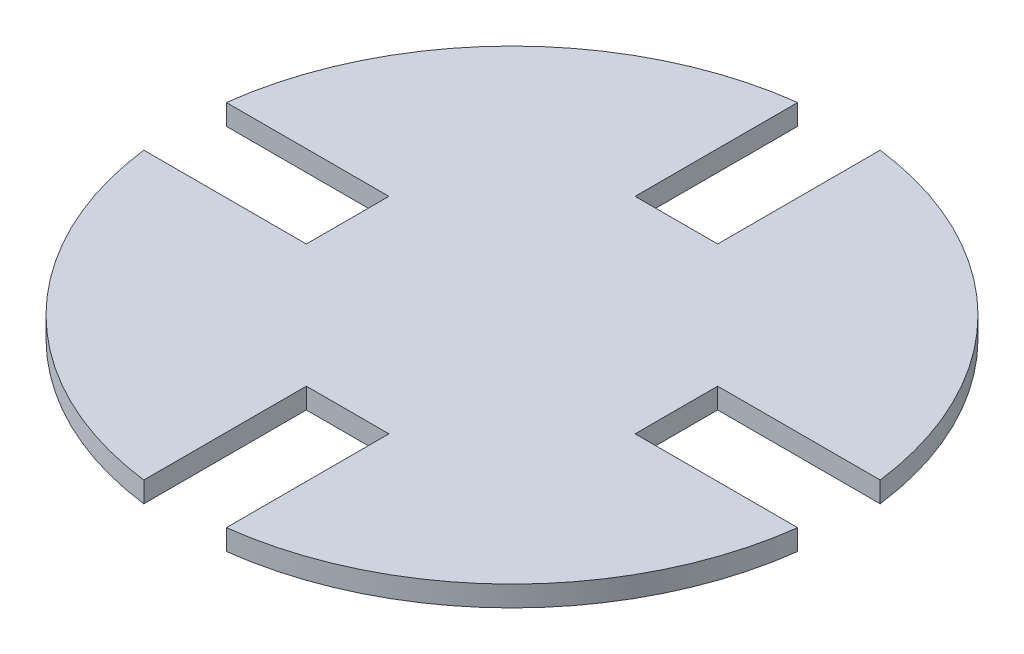
ISO-10303-21;
HEADER;
FILE_DESCRIPTION(('STEP AP214'),'2;1');
FILE_NAME('part.step','',(''),(''),'','','');
FILE_SCHEMA(('AUTOMOTIVE_DESIGN { 1 0 10303 214 1 1 1 1 }'));
ENDSEC;
DATA;
#1=APPLICATION_CONTEXT('core data for automotive mechanical design processes');
#2=APPLICATION_PROTOCOL_DEFINITION('international standard','automotive_design',2000,#1);
#3=PRODUCT_CONTEXT('',#1,'mechanical');
#4=PRODUCT('Part','Part','',(#3));
#5=PRODUCT_RELATED_PRODUCT_CATEGORY('part','',(#4));
#6=PRODUCT_DEFINITION_FORMATION('','',#4);
#7=PRODUCT_DEFINITION_CONTEXT('part definition',#1,'design');
#8=PRODUCT_DEFINITION('design','',#6,#7);
#9=PRODUCT_DEFINITION_SHAPE('','',#8);
#10=(LENGTH_UNIT() NAMED_UNIT(*) SI_UNIT(.MILLI.,.METRE.));
#11=(NAMED_UNIT(*) PLANE_ANGLE_UNIT() SI_UNIT($,.RADIAN.));
#12=(NAMED_UNIT(*) SI_UNIT($,.STERADIAN.) SOLID_ANGLE_UNIT());
#13=UNCERTAINTY_MEASURE_WITH_UNIT(LENGTH_MEASURE(1.E-05),#10,'distance_accuracy_value','');
#14=(GEOMETRIC_REPRESENTATION_CONTEXT(3) GLOBAL_UNCERTAINTY_ASSIGNED_CONTEXT((#13)) GLOBAL_UNIT_ASSIGNED_CONTEXT((#10,
#11,#12)) REPRESENTATION_CONTEXT('',''));
#15=CARTESIAN_POINT('',(0.,0.,0.));
#16=DIRECTION('',(0.,0.,1.));
#17=DIRECTION('',(1.,0.,0.));
#18=AXIS2_PLACEMENT_3D('',#15,#16,#17);
#19=CARTESIAN_POINT('',(0.,6.35,0.));
#20=DIRECTION('',(0.,-1.,0.));
#21=DIRECTION('',(0.,0.,-1.));
#22=AXIS2_PLACEMENT_3D('',#19,#20,#21);
#23=CYLINDRICAL_SURFACE('',#22,101.374642804694);
#24=DIRECTION('',(0.,1.,0.));
#25=VECTOR('',#24,1.);
#26=CARTESIAN_POINT('',(12.7,0.,-100.575982241186));
#27=LINE('',#26,#25);
#28=CARTESIAN_POINT('',(12.7,0.,-100.575982241186));
#29=VERTEX_POINT('',#28);
#30=CARTESIAN_POINT('',(12.7,6.35,-100.575982241186));
#31=VERTEX_POINT('',#30);
#32=EDGE_CURVE('E182',#29,#31,#27,.T.);
#33=ORIENTED_EDGE('',*,*,#32,.T.);
#34=CARTESIAN_POINT('',(0.,6.35,0.));
#35=DIRECTION('',(0.,1.,0.));
#36=DIRECTION('',(0.,0.,1.));
#37=AXIS2_PLACEMENT_3D('',#34,#35,#36);
#38=CIRCLE('',#37,101.374642804694);
#39=CARTESIAN_POINT('',(100.575982241186,6.35,-12.6999999999997));
#40=VERTEX_POINT('',#39);
#41=EDGE_CURVE('E289',#40,#31,#38,.T.);
#42=ORIENTED_EDGE('',*,*,#41,.F.);
#43=DIRECTION('',(0.,1.,0.));
#44=VECTOR('',#43,1.);
#45=CARTESIAN_POINT('',(100.575982241186,0.,-12.6999999999997));
#46=LINE('',#45,#44);
#47=CARTESIAN_POINT('',(100.575982241186,0.,-12.6999999999997));
#48=VERTEX_POINT('',#47);
#49=EDGE_CURVE('E193',#48,#40,#46,.T.);
#50=ORIENTED_EDGE('',*,*,#49,.F.);
#51=CARTESIAN_POINT('',(0.,0.,0.));
#52=DIRECTION('',(0.,1.,0.));
#53=DIRECTION('',(0.,0.,1.));
#54=AXIS2_PLACEMENT_3D('',#51,#52,#53);
#55=CIRCLE('',#54,101.374642804694);
#56=EDGE_CURVE('E296',#48,#29,#55,.T.);
#57=ORIENTED_EDGE('',*,*,#56,.T.);
#58=EDGE_LOOP('',(#33,#42,#50,#57));
#59=FACE_BOUND('',#58,.T.);
#60=ADVANCED_FACE('F33',(#59),#23,.T.);
#61=DIRECTION('',(0.,1.,0.));
#62=VECTOR('',#61,1.);
#63=CARTESIAN_POINT('',(100.575982241186,0.,12.7000000000003));
#64=LINE('',#63,#62);
#65=CARTESIAN_POINT('',(100.575982241186,0.,12.7000000000003));
#66=VERTEX_POINT('',#65);
#67=CARTESIAN_POINT('',(100.575982241186,6.35,12.7000000000003));
#68=VERTEX_POINT('',#67);
#69=EDGE_CURVE('E177',#66,#68,#64,.T.);
#70=ORIENTED_EDGE('',*,*,#69,.T.);
#71=CARTESIAN_POINT('',(12.7,6.35,100.575982241186));
#72=VERTEX_POINT('',#71);
#73=EDGE_CURVE('E42',#72,#68,#38,.T.);
#74=ORIENTED_EDGE('',*,*,#73,.F.);
#75=DIRECTION('',(0.,1.,0.));
#76=VECTOR('',#75,1.);
#77=CARTESIAN_POINT('',(12.7,0.,100.575982241186));
#78=LINE('',#77,#76);
#79=CARTESIAN_POINT('',(12.7,0.,100.575982241186));
#80=VERTEX_POINT('',#79);
#81=EDGE_CURVE('E228',#80,#72,#78,.T.);
#82=ORIENTED_EDGE('',*,*,#81,.F.);
#83=EDGE_CURVE('E295',#80,#66,#55,.T.);
#84=ORIENTED_EDGE('',*,*,#83,.T.);
#85=EDGE_LOOP('',(#70,#74,#82,#84));
#86=FACE_BOUND('',#85,.T.);
#87=ADVANCED_FACE('F287',(#86),#23,.T.);
#88=CARTESIAN_POINT('',(-12.7,6.35,-100.575982241186));
#89=VERTEX_POINT('',#88);
#90=CARTESIAN_POINT('',(-100.575982241186,6.35,-12.7000000000011));
#91=VERTEX_POINT('',#90);
#92=EDGE_CURVE('E43',#89,#91,#38,.T.);
#93=ORIENTED_EDGE('',*,*,#92,.F.);
#94=DIRECTION('',(0.,1.,0.));
#95=VECTOR('',#94,1.);
#96=CARTESIAN_POINT('',(-12.7,0.,-100.575982241186));
#97=LINE('',#96,#95);
#98=CARTESIAN_POINT('',(-12.7,0.,-100.575982241186));
#99=VERTEX_POINT('',#98);
#100=EDGE_CURVE('E179',#99,#89,#97,.T.);
#101=ORIENTED_EDGE('',*,*,#100,.F.);
#102=CARTESIAN_POINT('',(-100.575982241186,0.,-12.7000000000011));
#103=VERTEX_POINT('',#102);
#104=EDGE_CURVE('E168',#99,#103,#55,.T.);
#105=ORIENTED_EDGE('',*,*,#104,.T.);
#106=DIRECTION('',(0.,1.,0.));
#107=VECTOR('',#106,1.);
#108=CARTESIAN_POINT('',(-100.575982241186,0.,-12.7000000000011));
#109=LINE('',#108,#107);
#110=EDGE_CURVE('E251',#103,#91,#109,.T.);
#111=ORIENTED_EDGE('',*,*,#110,.T.);
#112=EDGE_LOOP('',(#93,#101,#105,#111));
#113=FACE_BOUND('',#112,.T.);
#114=ADVANCED_FACE('F305',(#113),#23,.T.);
#115=CARTESIAN_POINT('',(0.,6.35,0.));
#116=DIRECTION('',(0.,1.,0.));
#117=DIRECTION('',(0.,0.,1.));
#118=AXIS2_PLACEMENT_3D('',#115,#116,#117);
#119=PLANE('',#118);
#120=DIRECTION('',(0.,0.,1.));
#121=VECTOR('',#120,1.);
#122=CARTESIAN_POINT('',(-12.7,6.35,0.));
#123=LINE('',#122,#121);
#124=CARTESIAN_POINT('',(-12.7,6.35,-50.5746428046944));
#125=VERTEX_POINT('',#124);
#126=EDGE_CURVE('E155',#89,#125,#123,.T.);
#127=ORIENTED_EDGE('',*,*,#126,.F.);
#128=ORIENTED_EDGE('',*,*,#92,.T.);
#129=DIRECTION('',(1.,0.,0.));
#130=VECTOR('',#129,1.);
#131=CARTESIAN_POINT('',(1.35308431126191E-13,6.35,-12.7));
#132=LINE('',#131,#130);
#133=CARTESIAN_POINT('',(-50.5746428046943,6.35,-12.7000000000005));
#134=VERTEX_POINT('',#133);
#135=EDGE_CURVE('E238',#91,#134,#132,.T.);
#136=ORIENTED_EDGE('',*,*,#135,.T.);
#137=DIRECTION('',(0.,0.,-1.));
#138=VECTOR('',#137,1.);
#139=CARTESIAN_POINT('',(-50.5746428046944,6.35,-5.25016498609907E-13));
#140=LINE('',#139,#138);
#141=CARTESIAN_POINT('',(-50.5746428046946,6.35,12.6999999999995));
#142=VERTEX_POINT('',#141);
#143=EDGE_CURVE('E246',#142,#134,#140,.T.);
#144=ORIENTED_EDGE('',*,*,#143,.F.);
#145=DIRECTION('',(1.,0.,0.));
#146=VECTOR('',#145,1.);
#147=CARTESIAN_POINT('',(-1.31303288675929E-13,6.35,12.7));
#148=LINE('',#147,#146);
#149=CARTESIAN_POINT('',(-100.575982241186,6.35,12.6999999999989));
#150=VERTEX_POINT('',#149);
#151=EDGE_CURVE('E181',#150,#142,#148,.T.);
#152=ORIENTED_EDGE('',*,*,#151,.F.);
#153=CARTESIAN_POINT('',(-12.7,6.35,100.575982241186));
#154=VERTEX_POINT('',#153);
#155=EDGE_CURVE('E11',#150,#154,#38,.T.);
#156=ORIENTED_EDGE('',*,*,#155,.T.);
#157=DIRECTION('',(0.,0.,1.));
#158=VECTOR('',#157,1.);
#159=CARTESIAN_POINT('',(-12.7,6.35,0.));
#160=LINE('',#159,#158);
#161=CARTESIAN_POINT('',(-12.7,6.35,50.5746428046944));
#162=VERTEX_POINT('',#161);
#163=EDGE_CURVE('E222',#162,#154,#160,.T.);
#164=ORIENTED_EDGE('',*,*,#163,.F.);
#165=DIRECTION('',(1.,0.,0.));
#166=VECTOR('',#165,1.);
#167=CARTESIAN_POINT('',(0.,6.35,50.5746428046944));
#168=LINE('',#167,#166);
#169=CARTESIAN_POINT('',(12.7,6.35,50.5746428046944));
#170=VERTEX_POINT('',#169);
#171=EDGE_CURVE('E219',#162,#170,#168,.T.);
#172=ORIENTED_EDGE('',*,*,#171,.T.);
#173=DIRECTION('',(0.,0.,1.));
#174=VECTOR('',#173,1.);
#175=CARTESIAN_POINT('',(12.7,6.35,0.));
#176=LINE('',#175,#174);
#177=EDGE_CURVE('E213',#170,#72,#176,.T.);
#178=ORIENTED_EDGE('',*,*,#177,.T.);
#179=ORIENTED_EDGE('',*,*,#73,.T.);
#180=DIRECTION('',(-1.,0.,0.));
#181=VECTOR('',#180,1.);
#182=CARTESIAN_POINT('',(0.,6.35,12.7));
#183=LINE('',#182,#181);
#184=CARTESIAN_POINT('',(50.5746428046944,6.35,12.7000000000002));
#185=VERTEX_POINT('',#184);
#186=EDGE_CURVE('E189',#68,#185,#183,.T.);
#187=ORIENTED_EDGE('',*,*,#186,.T.);
#188=DIRECTION('',(0.,0.,1.));
#189=VECTOR('',#188,1.);
#190=CARTESIAN_POINT('',(50.5746428046944,6.35,1.6579468377155E-13));
#191=LINE('',#190,#189);
#192=CARTESIAN_POINT('',(50.5746428046945,6.35,-12.6999999999998));
#193=VERTEX_POINT('',#192);
#194=EDGE_CURVE('E197',#193,#185,#191,.T.);
#195=ORIENTED_EDGE('',*,*,#194,.F.);
#196=DIRECTION('',(-1.,0.,0.));
#197=VECTOR('',#196,1.);
#198=CARTESIAN_POINT('',(0.,6.35,-12.7));
#199=LINE('',#198,#197);
#200=EDGE_CURVE('E194',#40,#193,#199,.T.);
#201=ORIENTED_EDGE('',*,*,#200,.F.);
#202=ORIENTED_EDGE('',*,*,#41,.T.);
#203=DIRECTION('',(0.,0.,1.));
#204=VECTOR('',#203,1.);
#205=CARTESIAN_POINT('',(12.7,6.35,0.));
#206=LINE('',#205,#204);
#207=CARTESIAN_POINT('',(12.7,6.35,-50.5746428046944));
#208=VERTEX_POINT('',#207);
#209=EDGE_CURVE('E169',#31,#208,#206,.T.);
#210=ORIENTED_EDGE('',*,*,#209,.T.);
#211=DIRECTION('',(1.,0.,0.));
#212=VECTOR('',#211,1.);
#213=CARTESIAN_POINT('',(0.,6.35,-50.5746428046944));
#214=LINE('',#213,#212);
#215=EDGE_CURVE('E172',#125,#208,#214,.T.);
#216=ORIENTED_EDGE('',*,*,#215,.F.);
#217=EDGE_LOOP('',(#127,#128,#136,#144,#152,#156,#164,#172,#178,#179,#187,#195,#201,#202,#210,#216));
#218=FACE_BOUND('',#217,.T.);
#219=ADVANCED_FACE('F269',(#218),#119,.T.);
#220=CARTESIAN_POINT('',(0.,0.,0.));
#221=DIRECTION('',(0.,1.,0.));
#222=DIRECTION('',(0.,0.,1.));
#223=AXIS2_PLACEMENT_3D('',#220,#221,#222);
#224=PLANE('',#223);
#225=ORIENTED_EDGE('',*,*,#104,.F.);
#226=DIRECTION('',(0.,0.,1.));
#227=VECTOR('',#226,1.);
#228=CARTESIAN_POINT('',(-12.7,0.,0.));
#229=LINE('',#228,#227);
#230=CARTESIAN_POINT('',(-12.7,0.,-50.5746428046944));
#231=VERTEX_POINT('',#230);
#232=EDGE_CURVE('E152',#99,#231,#229,.T.);
#233=ORIENTED_EDGE('',*,*,#232,.T.);
#234=DIRECTION('',(1.,0.,0.));
#235=VECTOR('',#234,1.);
#236=CARTESIAN_POINT('',(0.,0.,-50.5746428046944));
#237=LINE('',#236,#235);
#238=CARTESIAN_POINT('',(12.7,0.,-50.5746428046944));
#239=VERTEX_POINT('',#238);
#240=EDGE_CURVE('E160',#231,#239,#237,.T.);
#241=ORIENTED_EDGE('',*,*,#240,.T.);
#242=DIRECTION('',(0.,0.,1.));
#243=VECTOR('',#242,1.);
#244=CARTESIAN_POINT('',(12.7,0.,0.));
#245=LINE('',#244,#243);
#246=EDGE_CURVE('E157',#29,#239,#245,.T.);
#247=ORIENTED_EDGE('',*,*,#246,.F.);
#248=ORIENTED_EDGE('',*,*,#56,.F.);
#249=DIRECTION('',(-1.,0.,0.));
#250=VECTOR('',#249,1.);
#251=CARTESIAN_POINT('',(0.,0.,-12.7));
#252=LINE('',#251,#250);
#253=CARTESIAN_POINT('',(50.5746428046945,0.,-12.6999999999998));
#254=VERTEX_POINT('',#253);
#255=EDGE_CURVE('E186',#48,#254,#252,.T.);
#256=ORIENTED_EDGE('',*,*,#255,.T.);
#257=DIRECTION('',(0.,0.,1.));
#258=VECTOR('',#257,1.);
#259=CARTESIAN_POINT('',(50.5746428046944,0.,1.6579468377155E-13));
#260=LINE('',#259,#258);
#261=CARTESIAN_POINT('',(50.5746428046944,0.,12.7000000000002));
#262=VERTEX_POINT('',#261);
#263=EDGE_CURVE('E58',#254,#262,#260,.T.);
#264=ORIENTED_EDGE('',*,*,#263,.T.);
#265=DIRECTION('',(-1.,0.,0.));
#266=VECTOR('',#265,1.);
#267=CARTESIAN_POINT('',(0.,0.,12.7));
#268=LINE('',#267,#266);
#269=EDGE_CURVE('E191',#66,#262,#268,.T.);
#270=ORIENTED_EDGE('',*,*,#269,.F.);
#271=ORIENTED_EDGE('',*,*,#83,.F.);
#272=DIRECTION('',(0.,0.,1.));
#273=VECTOR('',#272,1.);
#274=CARTESIAN_POINT('',(12.7,0.,0.));
#275=LINE('',#274,#273);
#276=CARTESIAN_POINT('',(12.7,0.,50.5746428046944));
#277=VERTEX_POINT('',#276);
#278=EDGE_CURVE('E216',#277,#80,#275,.T.);
#279=ORIENTED_EDGE('',*,*,#278,.F.);
#280=DIRECTION('',(1.,0.,0.));
#281=VECTOR('',#280,1.);
#282=CARTESIAN_POINT('',(0.,0.,50.5746428046944));
#283=LINE('',#282,#281);
#284=CARTESIAN_POINT('',(-12.7,0.,50.5746428046944));
#285=VERTEX_POINT('',#284);
#286=EDGE_CURVE('E210',#285,#277,#283,.T.);
#287=ORIENTED_EDGE('',*,*,#286,.F.);
#288=DIRECTION('',(0.,0.,1.));
#289=VECTOR('',#288,1.);
#290=CARTESIAN_POINT('',(-12.7,0.,0.));
#291=LINE('',#290,#289);
#292=CARTESIAN_POINT('',(-12.7,0.,100.575982241186));
#293=VERTEX_POINT('',#292);
#294=EDGE_CURVE('E212',#285,#293,#291,.T.);
#295=ORIENTED_EDGE('',*,*,#294,.T.);
#296=CARTESIAN_POINT('',(-100.575982241186,0.,12.6999999999989));
#297=VERTEX_POINT('',#296);
#298=EDGE_CURVE('E37',#297,#293,#55,.T.);
#299=ORIENTED_EDGE('',*,*,#298,.F.);
#300=DIRECTION('',(1.,0.,0.));
#301=VECTOR('',#300,1.);
#302=CARTESIAN_POINT('',(-1.31303288675929E-13,0.,12.7));
#303=LINE('',#302,#301);
#304=CARTESIAN_POINT('',(-50.5746428046946,0.,12.6999999999995));
#305=VERTEX_POINT('',#304);
#306=EDGE_CURVE('E234',#297,#305,#303,.T.);
#307=ORIENTED_EDGE('',*,*,#306,.T.);
#308=DIRECTION('',(0.,0.,-1.));
#309=VECTOR('',#308,1.);
#310=CARTESIAN_POINT('',(-50.5746428046944,0.,-5.25016498609907E-13));
#311=LINE('',#310,#309);
#312=CARTESIAN_POINT('',(-50.5746428046943,0.,-12.7000000000005));
#313=VERTEX_POINT('',#312);
#314=EDGE_CURVE('E237',#305,#313,#311,.T.);
#315=ORIENTED_EDGE('',*,*,#314,.T.);
#316=DIRECTION('',(1.,0.,0.));
#317=VECTOR('',#316,1.);
#318=CARTESIAN_POINT('',(1.35308431126191E-13,0.,-12.7));
#319=LINE('',#318,#317);
#320=EDGE_CURVE('E241',#103,#313,#319,.T.);
#321=ORIENTED_EDGE('',*,*,#320,.F.);
#322=EDGE_LOOP('',(#225,#233,#241,#247,#248,#256,#264,#270,#271,#279,#287,#295,#299,#307,#315,#321));
#323=FACE_BOUND('',#322,.T.);
#324=ADVANCED_FACE('F166',(#323),#224,.F.);
#325=ORIENTED_EDGE('',*,*,#298,.T.);
#326=DIRECTION('',(0.,1.,0.));
#327=VECTOR('',#326,1.);
#328=CARTESIAN_POINT('',(-12.7,0.,100.575982241186));
#329=LINE('',#328,#327);
#330=EDGE_CURVE('E230',#293,#154,#329,.T.);
#331=ORIENTED_EDGE('',*,*,#330,.T.);
#332=ORIENTED_EDGE('',*,*,#155,.F.);
#333=DIRECTION('',(0.,1.,0.));
#334=VECTOR('',#333,1.);
#335=CARTESIAN_POINT('',(-100.575982241186,0.,12.6999999999989));
#336=LINE('',#335,#334);
#337=EDGE_CURVE('E243',#297,#150,#336,.T.);
#338=ORIENTED_EDGE('',*,*,#337,.F.);
#339=EDGE_LOOP('',(#325,#331,#332,#338));
#340=FACE_BOUND('',#339,.T.);
#341=ADVANCED_FACE('F35',(#340),#23,.T.);
#342=CARTESIAN_POINT('',(1.35308431126191E-13,0.,-12.7));
#343=DIRECTION('',(0.,0.,1.));
#344=DIRECTION('',(1.,0.,0.));
#345=AXIS2_PLACEMENT_3D('',#342,#343,#344);
#346=PLANE('',#345);
#347=ORIENTED_EDGE('',*,*,#135,.F.);
#348=ORIENTED_EDGE('',*,*,#110,.F.);
#349=ORIENTED_EDGE('',*,*,#320,.T.);
#350=DIRECTION('',(0.,1.,0.));
#351=VECTOR('',#350,1.);
#352=CARTESIAN_POINT('',(-50.5746428046943,0.,-12.7000000000005));
#353=LINE('',#352,#351);
#354=EDGE_CURVE('E254',#313,#134,#353,.T.);
#355=ORIENTED_EDGE('',*,*,#354,.T.);
#356=EDGE_LOOP('',(#347,#348,#349,#355));
#357=FACE_BOUND('',#356,.T.);
#358=ADVANCED_FACE('F307',(#357),#346,.T.);
#359=CARTESIAN_POINT('',(-50.5746428046944,0.,-5.25016498609907E-13));
#360=DIRECTION('',(1.,0.,0.));
#361=DIRECTION('',(0.,0.,-1.));
#362=AXIS2_PLACEMENT_3D('',#359,#360,#361);
#363=PLANE('',#362);
#364=ORIENTED_EDGE('',*,*,#143,.T.);
#365=ORIENTED_EDGE('',*,*,#354,.F.);
#366=ORIENTED_EDGE('',*,*,#314,.F.);
#367=DIRECTION('',(0.,1.,0.));
#368=VECTOR('',#367,1.);
#369=CARTESIAN_POINT('',(-50.5746428046946,0.,12.6999999999995));
#370=LINE('',#369,#368);
#371=EDGE_CURVE('E256',#305,#142,#370,.T.);
#372=ORIENTED_EDGE('',*,*,#371,.T.);
#373=EDGE_LOOP('',(#364,#365,#366,#372));
#374=FACE_BOUND('',#373,.T.);
#375=ADVANCED_FACE('F310',(#374),#363,.F.);
#376=CARTESIAN_POINT('',(-1.31303288675929E-13,0.,12.7));
#377=DIRECTION('',(0.,0.,1.));
#378=DIRECTION('',(1.,0.,0.));
#379=AXIS2_PLACEMENT_3D('',#376,#377,#378);
#380=PLANE('',#379);
#381=ORIENTED_EDGE('',*,*,#151,.T.);
#382=ORIENTED_EDGE('',*,*,#371,.F.);
#383=ORIENTED_EDGE('',*,*,#306,.F.);
#384=ORIENTED_EDGE('',*,*,#337,.T.);
#385=EDGE_LOOP('',(#381,#382,#383,#384));
#386=FACE_BOUND('',#385,.T.);
#387=ADVANCED_FACE('F261',(#386),#380,.F.);
#388=CARTESIAN_POINT('',(0.,0.,50.5746428046944));
#389=DIRECTION('',(0.,0.,1.));
#390=DIRECTION('',(1.,0.,0.));
#391=AXIS2_PLACEMENT_3D('',#388,#389,#390);
#392=PLANE('',#391);
#393=ORIENTED_EDGE('',*,*,#171,.F.);
#394=DIRECTION('',(0.,1.,0.));
#395=VECTOR('',#394,1.);
#396=CARTESIAN_POINT('',(-12.7,0.,50.5746428046944));
#397=LINE('',#396,#395);
#398=EDGE_CURVE('E218',#285,#162,#397,.T.);
#399=ORIENTED_EDGE('',*,*,#398,.F.);
#400=ORIENTED_EDGE('',*,*,#286,.T.);
#401=DIRECTION('',(0.,1.,0.));
#402=VECTOR('',#401,1.);
#403=CARTESIAN_POINT('',(12.7,0.,50.5746428046944));
#404=LINE('',#403,#402);
#405=EDGE_CURVE('E198',#277,#170,#404,.T.);
#406=ORIENTED_EDGE('',*,*,#405,.T.);
#407=EDGE_LOOP('',(#393,#399,#400,#406));
#408=FACE_BOUND('',#407,.T.);
#409=ADVANCED_FACE('F280',(#408),#392,.T.);
#410=CARTESIAN_POINT('',(12.7,0.,0.));
#411=DIRECTION('',(-1.,0.,0.));
#412=DIRECTION('',(0.,0.,1.));
#413=AXIS2_PLACEMENT_3D('',#410,#411,#412);
#414=PLANE('',#413);
#415=ORIENTED_EDGE('',*,*,#177,.F.);
#416=ORIENTED_EDGE('',*,*,#405,.F.);
#417=ORIENTED_EDGE('',*,*,#278,.T.);
#418=ORIENTED_EDGE('',*,*,#81,.T.);
#419=EDGE_LOOP('',(#415,#416,#417,#418));
#420=FACE_BOUND('',#419,.T.);
#421=ADVANCED_FACE('F282',(#420),#414,.T.);
#422=CARTESIAN_POINT('',(-12.7,0.,0.));
#423=DIRECTION('',(-1.,0.,0.));
#424=DIRECTION('',(0.,0.,1.));
#425=AXIS2_PLACEMENT_3D('',#422,#423,#424);
#426=PLANE('',#425);
#427=ORIENTED_EDGE('',*,*,#163,.T.);
#428=ORIENTED_EDGE('',*,*,#330,.F.);
#429=ORIENTED_EDGE('',*,*,#294,.F.);
#430=ORIENTED_EDGE('',*,*,#398,.T.);
#431=EDGE_LOOP('',(#427,#428,#429,#430));
#432=FACE_BOUND('',#431,.T.);
#433=ADVANCED_FACE('F273',(#432),#426,.F.);
#434=CARTESIAN_POINT('',(0.,0.,12.7));
#435=DIRECTION('',(0.,0.,-1.));
#436=DIRECTION('',(-1.,0.,0.));
#437=AXIS2_PLACEMENT_3D('',#434,#435,#436);
#438=PLANE('',#437);
#439=ORIENTED_EDGE('',*,*,#186,.F.);
#440=ORIENTED_EDGE('',*,*,#69,.F.);
#441=ORIENTED_EDGE('',*,*,#269,.T.);
#442=DIRECTION('',(0.,1.,0.));
#443=VECTOR('',#442,1.);
#444=CARTESIAN_POINT('',(50.5746428046944,0.,12.7000000000002));
#445=LINE('',#444,#443);
#446=EDGE_CURVE('E205',#262,#185,#445,.T.);
#447=ORIENTED_EDGE('',*,*,#446,.T.);
#448=EDGE_LOOP('',(#439,#440,#441,#447));
#449=FACE_BOUND('',#448,.T.);
#450=ADVANCED_FACE('F389',(#449),#438,.T.);
#451=CARTESIAN_POINT('',(50.5746428046944,0.,1.6579468377155E-13));
#452=DIRECTION('',(-1.,0.,0.));
#453=DIRECTION('',(0.,0.,1.));
#454=AXIS2_PLACEMENT_3D('',#451,#452,#453);
#455=PLANE('',#454);
#456=ORIENTED_EDGE('',*,*,#194,.T.);
#457=ORIENTED_EDGE('',*,*,#446,.F.);
#458=ORIENTED_EDGE('',*,*,#263,.F.);
#459=DIRECTION('',(0.,1.,0.));
#460=VECTOR('',#459,1.);
#461=CARTESIAN_POINT('',(50.5746428046945,0.,-12.6999999999998));
#462=LINE('',#461,#460);
#463=EDGE_CURVE('E207',#254,#193,#462,.T.);
#464=ORIENTED_EDGE('',*,*,#463,.T.);
#465=EDGE_LOOP('',(#456,#457,#458,#464));
#466=FACE_BOUND('',#465,.T.);
#467=ADVANCED_FACE('F398',(#466),#455,.F.);
#468=CARTESIAN_POINT('',(0.,0.,-12.7));
#469=DIRECTION('',(0.,0.,-1.));
#470=DIRECTION('',(-1.,0.,0.));
#471=AXIS2_PLACEMENT_3D('',#468,#469,#470);
#472=PLANE('',#471);
#473=ORIENTED_EDGE('',*,*,#200,.T.);
#474=ORIENTED_EDGE('',*,*,#463,.F.);
#475=ORIENTED_EDGE('',*,*,#255,.F.);
#476=ORIENTED_EDGE('',*,*,#49,.T.);
#477=EDGE_LOOP('',(#473,#474,#475,#476));
#478=FACE_BOUND('',#477,.T.);
#479=ADVANCED_FACE('F408',(#478),#472,.F.);
#480=CARTESIAN_POINT('',(-12.7,0.,0.));
#481=DIRECTION('',(-1.,0.,0.));
#482=DIRECTION('',(0.,0.,1.));
#483=AXIS2_PLACEMENT_3D('',#480,#481,#482);
#484=PLANE('',#483);
#485=ORIENTED_EDGE('',*,*,#126,.T.);
#486=DIRECTION('',(0.,1.,0.));
#487=VECTOR('',#486,1.);
#488=CARTESIAN_POINT('',(-12.7,0.,-50.5746428046944));
#489=LINE('',#488,#487);
#490=EDGE_CURVE('E149',#231,#125,#489,.T.);
#491=ORIENTED_EDGE('',*,*,#490,.F.);
#492=ORIENTED_EDGE('',*,*,#232,.F.);
#493=ORIENTED_EDGE('',*,*,#100,.T.);
#494=EDGE_LOOP('',(#485,#491,#492,#493));
#495=FACE_BOUND('',#494,.T.);
#496=ADVANCED_FACE('F150',(#495),#484,.F.);
#497=CARTESIAN_POINT('',(12.7,0.,0.));
#498=DIRECTION('',(-1.,0.,0.));
#499=DIRECTION('',(0.,0.,1.));
#500=AXIS2_PLACEMENT_3D('',#497,#498,#499);
#501=PLANE('',#500);
#502=ORIENTED_EDGE('',*,*,#209,.F.);
#503=ORIENTED_EDGE('',*,*,#32,.F.);
#504=ORIENTED_EDGE('',*,*,#246,.T.);
#505=DIRECTION('',(0.,1.,0.));
#506=VECTOR('',#505,1.);
#507=CARTESIAN_POINT('',(12.7,0.,-50.5746428046944));
#508=LINE('',#507,#506);
#509=EDGE_CURVE('E50',#239,#208,#508,.T.);
#510=ORIENTED_EDGE('',*,*,#509,.T.);
#511=EDGE_LOOP('',(#502,#503,#504,#510));
#512=FACE_BOUND('',#511,.T.);
#513=ADVANCED_FACE('F304',(#512),#501,.T.);
#514=CARTESIAN_POINT('',(0.,0.,-50.5746428046944));
#515=DIRECTION('',(0.,0.,1.));
#516=DIRECTION('',(1.,0.,0.));
#517=AXIS2_PLACEMENT_3D('',#514,#515,#516);
#518=PLANE('',#517);
#519=ORIENTED_EDGE('',*,*,#215,.T.);
#520=ORIENTED_EDGE('',*,*,#509,.F.);
#521=ORIENTED_EDGE('',*,*,#240,.F.);
#522=ORIENTED_EDGE('',*,*,#490,.T.);
#523=EDGE_LOOP('',(#519,#520,#521,#522));
#524=FACE_BOUND('',#523,.T.);
#525=ADVANCED_FACE('F161',(#524),#518,.F.);
#526=CLOSED_SHELL('',(#60,#87,#114,#219,#324,#341,#358,#375,#387,#409,#421,#433,#450,#467,#479,
#496,#513,#525));
#527=MANIFOLD_SOLID_BREP('B2',#526);
#528=ADVANCED_BREP_SHAPE_REPRESENTATION('',(#18,#527),#14);
#529=SHAPE_DEFINITION_REPRESENTATION(#9,#528);
ENDSEC;
END-ISO-10303-21;
